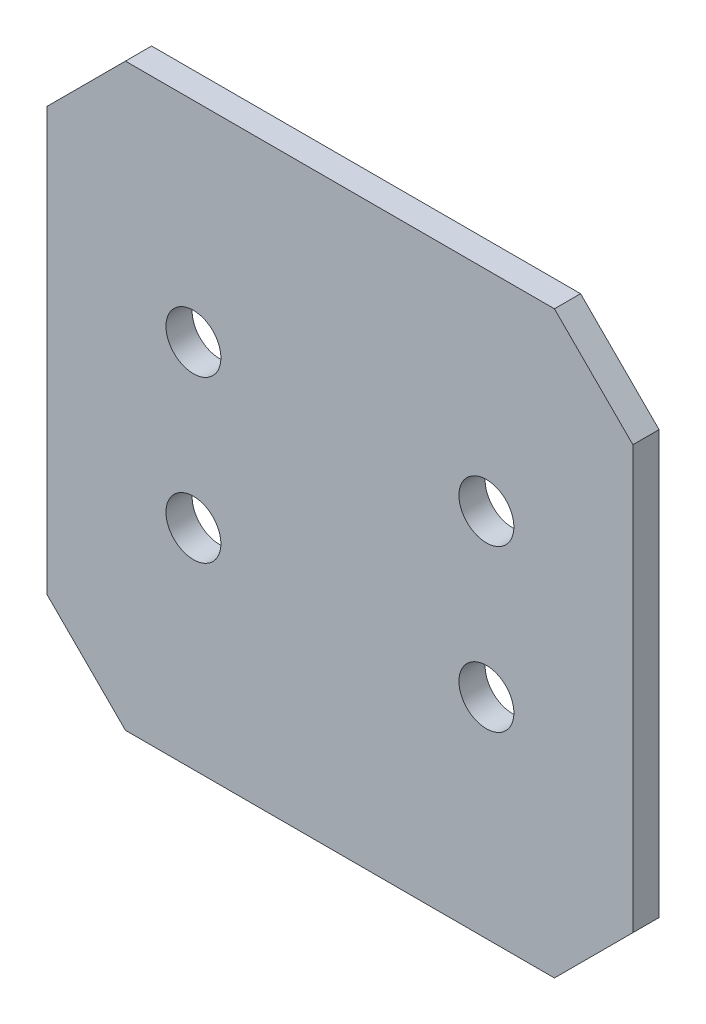
ISO-10303-21;
HEADER;
FILE_DESCRIPTION(('STEP AP214'),'2;1');
FILE_NAME('part.step','',(''),(''),'','','');
FILE_SCHEMA(('AUTOMOTIVE_DESIGN { 1 0 10303 214 1 1 1 1 }'));
ENDSEC;
DATA;
#1=APPLICATION_CONTEXT('core data for automotive mechanical design processes');
#2=APPLICATION_PROTOCOL_DEFINITION('international standard','automotive_design',2000,#1);
#3=PRODUCT_CONTEXT('',#1,'mechanical');
#4=PRODUCT('Part','Part','',(#3));
#5=PRODUCT_RELATED_PRODUCT_CATEGORY('part','',(#4));
#6=PRODUCT_DEFINITION_FORMATION('','',#4);
#7=PRODUCT_DEFINITION_CONTEXT('part definition',#1,'design');
#8=PRODUCT_DEFINITION('design','',#6,#7);
#9=PRODUCT_DEFINITION_SHAPE('','',#8);
#10=(LENGTH_UNIT() NAMED_UNIT(*) SI_UNIT(.MILLI.,.METRE.));
#11=(NAMED_UNIT(*) PLANE_ANGLE_UNIT() SI_UNIT($,.RADIAN.));
#12=(NAMED_UNIT(*) SI_UNIT($,.STERADIAN.) SOLID_ANGLE_UNIT());
#13=UNCERTAINTY_MEASURE_WITH_UNIT(LENGTH_MEASURE(1.E-05),#10,'distance_accuracy_value','');
#14=(GEOMETRIC_REPRESENTATION_CONTEXT(3) GLOBAL_UNCERTAINTY_ASSIGNED_CONTEXT((#13)) GLOBAL_UNIT_ASSIGNED_CONTEXT((#10,
#11,#12)) REPRESENTATION_CONTEXT('',''));
#15=CARTESIAN_POINT('',(0.,0.,0.));
#16=DIRECTION('',(0.,0.,1.));
#17=DIRECTION('',(1.,0.,0.));
#18=AXIS2_PLACEMENT_3D('',#15,#16,#17);
#19=CARTESIAN_POINT('',(55.9999999999995,3.00000000000045,-5.));
#20=DIRECTION('',(1.,0.,0.));
#21=DIRECTION('',(0.,1.,0.));
#22=AXIS2_PLACEMENT_3D('',#19,#20,#21);
#23=PLANE('',#22);
#24=DIRECTION('',(0.,1.,0.));
#25=VECTOR('',#24,1.);
#26=CARTESIAN_POINT('',(55.9999999999995,3.00000000000045,0.));
#27=LINE('',#26,#25);
#28=CARTESIAN_POINT('',(55.9999999999993,18.0000000000005,0.));
#29=VERTEX_POINT('',#28);
#30=CARTESIAN_POINT('',(55.9999999999988,98.7738106804795,0.));
#31=VERTEX_POINT('',#30);
#32=EDGE_CURVE('E162',#29,#31,#27,.T.);
#33=ORIENTED_EDGE('',*,*,#32,.F.);
#34=DIRECTION('',(0.,0.,-1.));
#35=VECTOR('',#34,1.);
#36=CARTESIAN_POINT('',(55.9999999999993,18.0000000000005,-5.));
#37=LINE('',#36,#35);
#38=CARTESIAN_POINT('',(55.9999999999993,18.0000000000005,-5.));
#39=VERTEX_POINT('',#38);
#40=EDGE_CURVE('E143',#29,#39,#37,.T.);
#41=ORIENTED_EDGE('',*,*,#40,.T.);
#42=DIRECTION('',(0.,1.,0.));
#43=VECTOR('',#42,1.);
#44=CARTESIAN_POINT('',(55.9999999999995,3.00000000000045,-5.));
#45=LINE('',#44,#43);
#46=CARTESIAN_POINT('',(55.9999999999988,98.7738106804795,-5.));
#47=VERTEX_POINT('',#46);
#48=EDGE_CURVE('E124',#39,#47,#45,.T.);
#49=ORIENTED_EDGE('',*,*,#48,.T.);
#50=DIRECTION('',(0.,0.,1.));
#51=VECTOR('',#50,1.);
#52=CARTESIAN_POINT('',(55.9999999999988,98.7738106804795,-5.));
#53=LINE('',#52,#51);
#54=EDGE_CURVE('E140',#47,#31,#53,.T.);
#55=ORIENTED_EDGE('',*,*,#54,.T.);
#56=EDGE_LOOP('',(#33,#41,#49,#55));
#57=FACE_BOUND('',#56,.T.);
#58=ADVANCED_FACE('F38',(#57),#23,.T.);
#59=CARTESIAN_POINT('',(55.9999999999995,3.00000000000045,-5.));
#60=DIRECTION('',(0.,-1.,0.));
#61=DIRECTION('',(1.,0.,0.));
#62=AXIS2_PLACEMENT_3D('',#59,#60,#61);
#63=PLANE('',#62);
#64=DIRECTION('',(1.,0.,0.));
#65=VECTOR('',#64,1.);
#66=CARTESIAN_POINT('',(55.9999999999995,3.00000000000045,-5.));
#67=LINE('',#66,#65);
#68=CARTESIAN_POINT('',(-40.9999999999995,3.00000000000006,-5.));
#69=VERTEX_POINT('',#68);
#70=CARTESIAN_POINT('',(40.9999999999995,3.00000000000039,-5.));
#71=VERTEX_POINT('',#70);
#72=EDGE_CURVE('E129',#69,#71,#67,.T.);
#73=ORIENTED_EDGE('',*,*,#72,.T.);
#74=DIRECTION('',(0.,0.,1.));
#75=VECTOR('',#74,1.);
#76=CARTESIAN_POINT('',(40.9999999999995,3.00000000000039,-5.));
#77=LINE('',#76,#75);
#78=CARTESIAN_POINT('',(40.9999999999995,3.00000000000039,0.));
#79=VERTEX_POINT('',#78);
#80=EDGE_CURVE('E123',#71,#79,#77,.T.);
#81=ORIENTED_EDGE('',*,*,#80,.T.);
#82=DIRECTION('',(1.,0.,0.));
#83=VECTOR('',#82,1.);
#84=CARTESIAN_POINT('',(55.9999999999995,3.00000000000045,0.));
#85=LINE('',#84,#83);
#86=CARTESIAN_POINT('',(-40.9999999999995,3.00000000000006,0.));
#87=VERTEX_POINT('',#86);
#88=EDGE_CURVE('E106',#87,#79,#85,.T.);
#89=ORIENTED_EDGE('',*,*,#88,.F.);
#90=DIRECTION('',(0.,0.,-1.));
#91=VECTOR('',#90,1.);
#92=CARTESIAN_POINT('',(-40.9999999999995,3.00000000000006,-5.));
#93=LINE('',#92,#91);
#94=EDGE_CURVE('E120',#87,#69,#93,.T.);
#95=ORIENTED_EDGE('',*,*,#94,.T.);
#96=EDGE_LOOP('',(#73,#81,#89,#95));
#97=FACE_BOUND('',#96,.T.);
#98=ADVANCED_FACE('F119',(#97),#63,.T.);
#99=CARTESIAN_POINT('',(-55.9999999999995,3.,-5.));
#100=DIRECTION('',(-1.,0.,0.));
#101=DIRECTION('',(0.,0.,1.));
#102=AXIS2_PLACEMENT_3D('',#99,#100,#101);
#103=PLANE('',#102);
#104=DIRECTION('',(0.,-1.,0.));
#105=VECTOR('',#104,1.);
#106=CARTESIAN_POINT('',(-55.9999999999995,3.,-5.));
#107=LINE('',#106,#105);
#108=CARTESIAN_POINT('',(-55.9999999999995,98.7738106804791,-5.));
#109=VERTEX_POINT('',#108);
#110=CARTESIAN_POINT('',(-55.9999999999995,17.9999999999999,-5.));
#111=VERTEX_POINT('',#110);
#112=EDGE_CURVE('E133',#109,#111,#107,.T.);
#113=ORIENTED_EDGE('',*,*,#112,.T.);
#114=DIRECTION('',(0.,0.,1.));
#115=VECTOR('',#114,1.);
#116=CARTESIAN_POINT('',(-55.9999999999995,17.9999999999999,-5.));
#117=LINE('',#116,#115);
#118=CARTESIAN_POINT('',(-55.9999999999995,17.9999999999999,0.));
#119=VERTEX_POINT('',#118);
#120=EDGE_CURVE('E153',#111,#119,#117,.T.);
#121=ORIENTED_EDGE('',*,*,#120,.T.);
#122=DIRECTION('',(0.,-1.,0.));
#123=VECTOR('',#122,1.);
#124=CARTESIAN_POINT('',(-55.9999999999995,3.,0.));
#125=LINE('',#124,#123);
#126=CARTESIAN_POINT('',(-55.9999999999995,98.7738106804791,0.));
#127=VERTEX_POINT('',#126);
#128=EDGE_CURVE('E108',#127,#119,#125,.T.);
#129=ORIENTED_EDGE('',*,*,#128,.F.);
#130=DIRECTION('',(0.,0.,-1.));
#131=VECTOR('',#130,1.);
#132=CARTESIAN_POINT('',(-55.9999999999995,98.7738106804791,-5.));
#133=LINE('',#132,#131);
#134=EDGE_CURVE('E151',#127,#109,#133,.T.);
#135=ORIENTED_EDGE('',*,*,#134,.T.);
#136=EDGE_LOOP('',(#113,#121,#129,#135));
#137=FACE_BOUND('',#136,.T.);
#138=ADVANCED_FACE('F234',(#137),#103,.T.);
#139=CARTESIAN_POINT('',(-55.9999999999995,113.773810680479,-5.));
#140=DIRECTION('',(0.,1.,0.));
#141=DIRECTION('',(-1.,0.,0.));
#142=AXIS2_PLACEMENT_3D('',#139,#140,#141);
#143=PLANE('',#142);
#144=DIRECTION('',(-1.,0.,0.));
#145=VECTOR('',#144,1.);
#146=CARTESIAN_POINT('',(-55.9999999999995,113.773810680479,0.));
#147=LINE('',#146,#145);
#148=CARTESIAN_POINT('',(40.9999999999986,113.77381068048,0.));
#149=VERTEX_POINT('',#148);
#150=CARTESIAN_POINT('',(-40.9999999999994,113.773810680479,0.));
#151=VERTEX_POINT('',#150);
#152=EDGE_CURVE('E158',#149,#151,#147,.T.);
#153=ORIENTED_EDGE('',*,*,#152,.F.);
#154=DIRECTION('',(0.,0.,-1.));
#155=VECTOR('',#154,1.);
#156=CARTESIAN_POINT('',(40.9999999999986,113.77381068048,-5.));
#157=LINE('',#156,#155);
#158=CARTESIAN_POINT('',(40.9999999999986,113.77381068048,-5.));
#159=VERTEX_POINT('',#158);
#160=EDGE_CURVE('E11',#149,#159,#157,.T.);
#161=ORIENTED_EDGE('',*,*,#160,.T.);
#162=DIRECTION('',(-1.,0.,0.));
#163=VECTOR('',#162,1.);
#164=CARTESIAN_POINT('',(-55.9999999999995,113.773810680479,-5.));
#165=LINE('',#164,#163);
#166=CARTESIAN_POINT('',(-40.9999999999994,113.773810680479,-5.));
#167=VERTEX_POINT('',#166);
#168=EDGE_CURVE('E159',#159,#167,#165,.T.);
#169=ORIENTED_EDGE('',*,*,#168,.T.);
#170=DIRECTION('',(0.,0.,1.));
#171=VECTOR('',#170,1.);
#172=CARTESIAN_POINT('',(-40.9999999999994,113.773810680479,-5.));
#173=LINE('',#172,#171);
#174=EDGE_CURVE('E46',#167,#151,#173,.T.);
#175=ORIENTED_EDGE('',*,*,#174,.T.);
#176=EDGE_LOOP('',(#153,#161,#169,#175));
#177=FACE_BOUND('',#176,.T.);
#178=ADVANCED_FACE('F157',(#177),#143,.T.);
#179=CARTESIAN_POINT('',(0.,0.,-5.));
#180=DIRECTION('',(0.,0.,-1.));
#181=DIRECTION('',(-1.,0.,0.));
#182=AXIS2_PLACEMENT_3D('',#179,#180,#181);
#183=PLANE('',#182);
#184=CARTESIAN_POINT('',(27.9999999999997,43.,-5.));
#185=DIRECTION('',(0.,0.,1.));
#186=DIRECTION('',(-1.,0.,0.));
#187=AXIS2_PLACEMENT_3D('',#184,#185,#186);
#188=CIRCLE('',#187,5.25);
#189=CARTESIAN_POINT('',(22.7499999999997,43.,-5.));
#190=VERTEX_POINT('',#189);
#191=EDGE_CURVE('E187',#190,#190,#188,.T.);
#192=ORIENTED_EDGE('',*,*,#191,.T.);
#193=EDGE_LOOP('',(#192));
#194=FACE_BOUND('',#193,.T.);
#195=CARTESIAN_POINT('',(27.9999999999994,73.7738106804792,-5.));
#196=DIRECTION('',(0.,0.,1.));
#197=DIRECTION('',(-1.,0.,0.));
#198=AXIS2_PLACEMENT_3D('',#195,#196,#197);
#199=CIRCLE('',#198,5.25000000000001);
#200=CARTESIAN_POINT('',(22.7499999999994,73.7738106804792,-5.));
#201=VERTEX_POINT('',#200);
#202=EDGE_CURVE('E181',#201,#201,#199,.T.);
#203=ORIENTED_EDGE('',*,*,#202,.T.);
#204=EDGE_LOOP('',(#203));
#205=FACE_BOUND('',#204,.T.);
#206=CARTESIAN_POINT('',(-28.,43.,-5.));
#207=DIRECTION('',(0.,0.,1.));
#208=DIRECTION('',(1.,0.,0.));
#209=AXIS2_PLACEMENT_3D('',#206,#207,#208);
#210=CIRCLE('',#209,5.25);
#211=CARTESIAN_POINT('',(-22.75,43.,-5.));
#212=VERTEX_POINT('',#211);
#213=EDGE_CURVE('E175',#212,#212,#210,.T.);
#214=ORIENTED_EDGE('',*,*,#213,.T.);
#215=EDGE_LOOP('',(#214));
#216=FACE_BOUND('',#215,.T.);
#217=CARTESIAN_POINT('',(-28.,73.7738106804792,-5.));
#218=DIRECTION('',(0.,0.,1.));
#219=DIRECTION('',(1.,0.,0.));
#220=AXIS2_PLACEMENT_3D('',#217,#218,#219);
#221=CIRCLE('',#220,5.25);
#222=CARTESIAN_POINT('',(-22.75,73.7738106804792,-5.));
#223=VERTEX_POINT('',#222);
#224=EDGE_CURVE('E164',#223,#223,#221,.T.);
#225=ORIENTED_EDGE('',*,*,#224,.T.);
#226=EDGE_LOOP('',(#225));
#227=FACE_BOUND('',#226,.T.);
#228=ORIENTED_EDGE('',*,*,#48,.F.);
#229=DIRECTION('',(0.707106781186542,0.707106781186553,0.));
#230=VECTOR('',#229,1.);
#231=CARTESIAN_POINT('',(18.9999999999999,-18.9999999999996,-5.));
#232=LINE('',#231,#230);
#233=EDGE_CURVE('E149',#39,#71,#232,.F.);
#234=ORIENTED_EDGE('',*,*,#233,.T.);
#235=ORIENTED_EDGE('',*,*,#72,.F.);
#236=DIRECTION('',(0.707106781186552,-0.707106781186543,0.));
#237=VECTOR('',#236,1.);
#238=CARTESIAN_POINT('',(-18.9999999999995,-18.9999999999997,-5.));
#239=LINE('',#238,#237);
#240=EDGE_CURVE('E128',#69,#111,#239,.F.);
#241=ORIENTED_EDGE('',*,*,#240,.T.);
#242=ORIENTED_EDGE('',*,*,#112,.F.);
#243=DIRECTION('',(-0.707106781186546,-0.707106781186549,0.));
#244=VECTOR('',#243,1.);
#245=CARTESIAN_POINT('',(-77.3869053402394,77.3869053402391,-5.));
#246=LINE('',#245,#244);
#247=EDGE_CURVE('E53',#109,#167,#246,.F.);
#248=ORIENTED_EDGE('',*,*,#247,.T.);
#249=ORIENTED_EDGE('',*,*,#168,.F.);
#250=DIRECTION('',(-0.707106781186552,0.707106781186543,0.));
#251=VECTOR('',#250,1.);
#252=CARTESIAN_POINT('',(77.3869053402388,77.3869053402398,-5.));
#253=LINE('',#252,#251);
#254=EDGE_CURVE('E146',#159,#47,#253,.F.);
#255=ORIENTED_EDGE('',*,*,#254,.T.);
#256=EDGE_LOOP('',(#228,#234,#235,#241,#242,#248,#249,#255));
#257=FACE_BOUND('',#256,.T.);
#258=ADVANCED_FACE('F196',(#194,#205,#216,#227,#257),#183,.T.);
#259=CARTESIAN_POINT('',(0.,0.,0.));
#260=DIRECTION('',(0.,0.,-1.));
#261=DIRECTION('',(-1.,0.,0.));
#262=AXIS2_PLACEMENT_3D('',#259,#260,#261);
#263=PLANE('',#262);
#264=CARTESIAN_POINT('',(27.9999999999997,43.,0.));
#265=DIRECTION('',(0.,0.,1.));
#266=DIRECTION('',(-1.,0.,0.));
#267=AXIS2_PLACEMENT_3D('',#264,#265,#266);
#268=CIRCLE('',#267,5.25);
#269=CARTESIAN_POINT('',(22.7499999999997,43.,0.));
#270=VERTEX_POINT('',#269);
#271=EDGE_CURVE('E190',#270,#270,#268,.T.);
#272=ORIENTED_EDGE('',*,*,#271,.F.);
#273=EDGE_LOOP('',(#272));
#274=FACE_BOUND('',#273,.T.);
#275=CARTESIAN_POINT('',(27.9999999999994,73.7738106804792,0.));
#276=DIRECTION('',(0.,0.,1.));
#277=DIRECTION('',(-1.,0.,0.));
#278=AXIS2_PLACEMENT_3D('',#275,#276,#277);
#279=CIRCLE('',#278,5.25000000000001);
#280=CARTESIAN_POINT('',(22.7499999999994,73.7738106804792,0.));
#281=VERTEX_POINT('',#280);
#282=EDGE_CURVE('E184',#281,#281,#279,.T.);
#283=ORIENTED_EDGE('',*,*,#282,.F.);
#284=EDGE_LOOP('',(#283));
#285=FACE_BOUND('',#284,.T.);
#286=CARTESIAN_POINT('',(-28.,43.,0.));
#287=DIRECTION('',(0.,0.,1.));
#288=DIRECTION('',(1.,0.,0.));
#289=AXIS2_PLACEMENT_3D('',#286,#287,#288);
#290=CIRCLE('',#289,5.25);
#291=CARTESIAN_POINT('',(-22.75,43.,0.));
#292=VERTEX_POINT('',#291);
#293=EDGE_CURVE('E178',#292,#292,#290,.T.);
#294=ORIENTED_EDGE('',*,*,#293,.F.);
#295=EDGE_LOOP('',(#294));
#296=FACE_BOUND('',#295,.T.);
#297=CARTESIAN_POINT('',(-28.,73.7738106804792,0.));
#298=DIRECTION('',(0.,0.,1.));
#299=DIRECTION('',(1.,0.,0.));
#300=AXIS2_PLACEMENT_3D('',#297,#298,#299);
#301=CIRCLE('',#300,5.25);
#302=CARTESIAN_POINT('',(-22.75,73.7738106804792,0.));
#303=VERTEX_POINT('',#302);
#304=EDGE_CURVE('E172',#303,#303,#301,.T.);
#305=ORIENTED_EDGE('',*,*,#304,.F.);
#306=EDGE_LOOP('',(#305));
#307=FACE_BOUND('',#306,.T.);
#308=ORIENTED_EDGE('',*,*,#88,.T.);
#309=DIRECTION('',(-0.707106781186542,-0.707106781186553,0.));
#310=VECTOR('',#309,1.);
#311=CARTESIAN_POINT('',(40.9999999999995,3.00000000000039,0.));
#312=LINE('',#311,#310);
#313=EDGE_CURVE('E113',#79,#29,#312,.F.);
#314=ORIENTED_EDGE('',*,*,#313,.T.);
#315=ORIENTED_EDGE('',*,*,#32,.T.);
#316=DIRECTION('',(0.707106781186552,-0.707106781186543,0.));
#317=VECTOR('',#316,1.);
#318=CARTESIAN_POINT('',(55.9999999999988,98.7738106804795,0.));
#319=LINE('',#318,#317);
#320=EDGE_CURVE('E114',#31,#149,#319,.F.);
#321=ORIENTED_EDGE('',*,*,#320,.T.);
#322=ORIENTED_EDGE('',*,*,#152,.T.);
#323=DIRECTION('',(0.707106781186546,0.707106781186549,0.));
#324=VECTOR('',#323,1.);
#325=CARTESIAN_POINT('',(-40.9999999999994,113.773810680479,0.));
#326=LINE('',#325,#324);
#327=EDGE_CURVE('E131',#151,#127,#326,.F.);
#328=ORIENTED_EDGE('',*,*,#327,.T.);
#329=ORIENTED_EDGE('',*,*,#128,.T.);
#330=DIRECTION('',(-0.707106781186552,0.707106781186543,0.));
#331=VECTOR('',#330,1.);
#332=CARTESIAN_POINT('',(-55.9999999999995,17.9999999999999,0.));
#333=LINE('',#332,#331);
#334=EDGE_CURVE('E103',#119,#87,#333,.F.);
#335=ORIENTED_EDGE('',*,*,#334,.T.);
#336=EDGE_LOOP('',(#308,#314,#315,#321,#322,#328,#329,#335));
#337=FACE_BOUND('',#336,.T.);
#338=ADVANCED_FACE('F105',(#274,#285,#296,#307,#337),#263,.F.);
#339=CARTESIAN_POINT('',(-28.,73.7738106804792,-5.));
#340=DIRECTION('',(0.,0.,1.));
#341=DIRECTION('',(1.,0.,0.));
#342=AXIS2_PLACEMENT_3D('',#339,#340,#341);
#343=CYLINDRICAL_SURFACE('',#342,5.25);
#344=ORIENTED_EDGE('',*,*,#224,.F.);
#345=EDGE_LOOP('',(#344));
#346=FACE_BOUND('',#345,.T.);
#347=ORIENTED_EDGE('',*,*,#304,.T.);
#348=EDGE_LOOP('',(#347));
#349=FACE_BOUND('',#348,.T.);
#350=ADVANCED_FACE('F209',(#346,#349),#343,.F.);
#351=CARTESIAN_POINT('',(-28.,43.,-5.));
#352=DIRECTION('',(0.,0.,1.));
#353=DIRECTION('',(1.,0.,0.));
#354=AXIS2_PLACEMENT_3D('',#351,#352,#353);
#355=CYLINDRICAL_SURFACE('',#354,5.25);
#356=ORIENTED_EDGE('',*,*,#213,.F.);
#357=EDGE_LOOP('',(#356));
#358=FACE_BOUND('',#357,.T.);
#359=ORIENTED_EDGE('',*,*,#293,.T.);
#360=EDGE_LOOP('',(#359));
#361=FACE_BOUND('',#360,.T.);
#362=ADVANCED_FACE('F218',(#358,#361),#355,.F.);
#363=CARTESIAN_POINT('',(27.9999999999994,73.7738106804792,-5.));
#364=DIRECTION('',(0.,0.,1.));
#365=DIRECTION('',(1.,0.,0.));
#366=AXIS2_PLACEMENT_3D('',#363,#364,#365);
#367=CYLINDRICAL_SURFACE('',#366,5.25000000000001);
#368=ORIENTED_EDGE('',*,*,#202,.F.);
#369=EDGE_LOOP('',(#368));
#370=FACE_BOUND('',#369,.T.);
#371=ORIENTED_EDGE('',*,*,#282,.T.);
#372=EDGE_LOOP('',(#371));
#373=FACE_BOUND('',#372,.T.);
#374=ADVANCED_FACE('F203',(#370,#373),#367,.F.);
#375=CARTESIAN_POINT('',(27.9999999999997,43.,-5.));
#376=DIRECTION('',(0.,0.,1.));
#377=DIRECTION('',(1.,0.,0.));
#378=AXIS2_PLACEMENT_3D('',#375,#376,#377);
#379=CYLINDRICAL_SURFACE('',#378,5.25);
#380=ORIENTED_EDGE('',*,*,#191,.F.);
#381=EDGE_LOOP('',(#380));
#382=FACE_BOUND('',#381,.T.);
#383=ORIENTED_EDGE('',*,*,#271,.T.);
#384=EDGE_LOOP('',(#383));
#385=FACE_BOUND('',#384,.T.);
#386=ADVANCED_FACE('F199',(#382,#385),#379,.F.);
#387=CARTESIAN_POINT('',(40.9999999999995,3.00000000000039,-5.));
#388=DIRECTION('',(-0.707106781186553,0.707106781186542,0.));
#389=DIRECTION('',(0.,0.,1.));
#390=AXIS2_PLACEMENT_3D('',#387,#388,#389);
#391=PLANE('',#390);
#392=ORIENTED_EDGE('',*,*,#233,.F.);
#393=ORIENTED_EDGE('',*,*,#40,.F.);
#394=ORIENTED_EDGE('',*,*,#313,.F.);
#395=ORIENTED_EDGE('',*,*,#80,.F.);
#396=EDGE_LOOP('',(#392,#393,#394,#395));
#397=FACE_BOUND('',#396,.T.);
#398=ADVANCED_FACE('F202',(#397),#391,.F.);
#399=CARTESIAN_POINT('',(-55.9999999999995,17.9999999999999,-5.));
#400=DIRECTION('',(0.707106781186543,0.707106781186552,0.));
#401=DIRECTION('',(0.,0.,1.));
#402=AXIS2_PLACEMENT_3D('',#399,#400,#401);
#403=PLANE('',#402);
#404=ORIENTED_EDGE('',*,*,#240,.F.);
#405=ORIENTED_EDGE('',*,*,#94,.F.);
#406=ORIENTED_EDGE('',*,*,#334,.F.);
#407=ORIENTED_EDGE('',*,*,#120,.F.);
#408=EDGE_LOOP('',(#404,#405,#406,#407));
#409=FACE_BOUND('',#408,.T.);
#410=ADVANCED_FACE('F127',(#409),#403,.F.);
#411=CARTESIAN_POINT('',(55.9999999999988,98.7738106804795,-5.));
#412=DIRECTION('',(-0.707106781186543,-0.707106781186552,0.));
#413=DIRECTION('',(0.,0.,1.));
#414=AXIS2_PLACEMENT_3D('',#411,#412,#413);
#415=PLANE('',#414);
#416=ORIENTED_EDGE('',*,*,#254,.F.);
#417=ORIENTED_EDGE('',*,*,#160,.F.);
#418=ORIENTED_EDGE('',*,*,#320,.F.);
#419=ORIENTED_EDGE('',*,*,#54,.F.);
#420=EDGE_LOOP('',(#416,#417,#418,#419));
#421=FACE_BOUND('',#420,.T.);
#422=ADVANCED_FACE('F244',(#421),#415,.F.);
#423=CARTESIAN_POINT('',(-40.9999999999994,113.773810680479,-5.));
#424=DIRECTION('',(0.707106781186549,-0.707106781186546,0.));
#425=DIRECTION('',(0.,0.,1.));
#426=AXIS2_PLACEMENT_3D('',#423,#424,#425);
#427=PLANE('',#426);
#428=ORIENTED_EDGE('',*,*,#247,.F.);
#429=ORIENTED_EDGE('',*,*,#134,.F.);
#430=ORIENTED_EDGE('',*,*,#327,.F.);
#431=ORIENTED_EDGE('',*,*,#174,.F.);
#432=EDGE_LOOP('',(#428,#429,#430,#431));
#433=FACE_BOUND('',#432,.T.);
#434=ADVANCED_FACE('F40',(#433),#427,.F.);
#435=CLOSED_SHELL('',(#58,#98,#138,#178,#258,#338,#350,#362,#374,#386,#398,#410,#422,#434));
#436=MANIFOLD_SOLID_BREP('B2',#435);
#437=ADVANCED_BREP_SHAPE_REPRESENTATION('',(#18,#436),#14);
#438=SHAPE_DEFINITION_REPRESENTATION(#9,#437);
ENDSEC;
END-ISO-10303-21;
